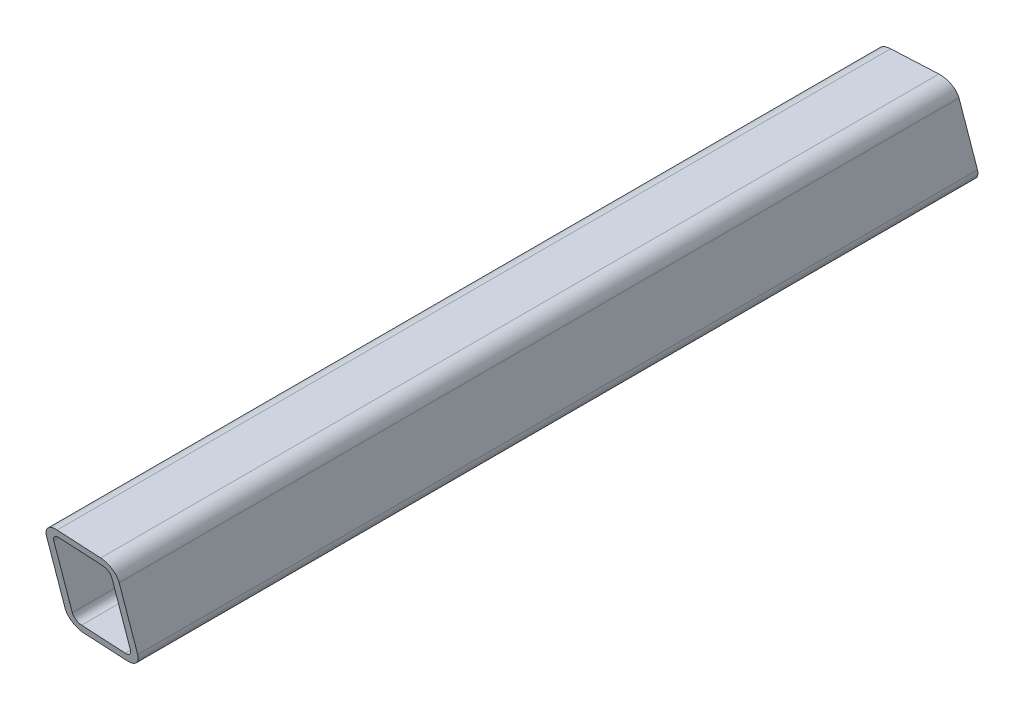
ISO-10303-21;
HEADER;
FILE_DESCRIPTION(('STEP AP214'),'2;1');
FILE_NAME('part.step','',(''),(''),'','','');
FILE_SCHEMA(('AUTOMOTIVE_DESIGN { 1 0 10303 214 1 1 1 1 }'));
ENDSEC;
DATA;
#1=APPLICATION_CONTEXT('core data for automotive mechanical design processes');
#2=APPLICATION_PROTOCOL_DEFINITION('international standard','automotive_design',2000,#1);
#3=PRODUCT_CONTEXT('',#1,'mechanical');
#4=PRODUCT('Part','Part','',(#3));
#5=PRODUCT_RELATED_PRODUCT_CATEGORY('part','',(#4));
#6=PRODUCT_DEFINITION_FORMATION('','',#4);
#7=PRODUCT_DEFINITION_CONTEXT('part definition',#1,'design');
#8=PRODUCT_DEFINITION('design','',#6,#7);
#9=PRODUCT_DEFINITION_SHAPE('','',#8);
#10=(LENGTH_UNIT() NAMED_UNIT(*) SI_UNIT(.MILLI.,.METRE.));
#11=(NAMED_UNIT(*) PLANE_ANGLE_UNIT() SI_UNIT($,.RADIAN.));
#12=(NAMED_UNIT(*) SI_UNIT($,.STERADIAN.) SOLID_ANGLE_UNIT());
#13=UNCERTAINTY_MEASURE_WITH_UNIT(LENGTH_MEASURE(1.E-05),#10,'distance_accuracy_value','');
#14=(GEOMETRIC_REPRESENTATION_CONTEXT(3) GLOBAL_UNCERTAINTY_ASSIGNED_CONTEXT((#13)) GLOBAL_UNIT_ASSIGNED_CONTEXT((#10,
#11,#12)) REPRESENTATION_CONTEXT('',''));
#15=CARTESIAN_POINT('',(0.,0.,0.));
#16=DIRECTION('',(0.,0.,1.));
#17=DIRECTION('',(1.,0.,0.));
#18=AXIS2_PLACEMENT_3D('',#15,#16,#17);
#19=CARTESIAN_POINT('',(-24.,-6.,-219.518847077111));
#20=DIRECTION('',(0.,0.,1.));
#21=DIRECTION('',(1.,0.,0.));
#22=AXIS2_PLACEMENT_3D('',#19,#20,#21);
#23=CYLINDRICAL_SURFACE('',#22,6.);
#24=CARTESIAN_POINT('',(-24.,-6.,-164.604766430197));
#25=DIRECTION('',(0.0474699173292238,-0.250097742672653,0.967056216596947));
#26=DIRECTION('',(-0.18033294434724,0.950093550784267,0.254562907630314));
#27=AXIS2_PLACEMENT_3D('',#24,#25,#26);
#28=ELLIPSE('',#27,6.20439628744014,6.);
#29=CARTESIAN_POINT('',(-28.4872652296078,-2.0169796938563,-163.354420818104));
#30=VERTEX_POINT('',#29);
#31=CARTESIAN_POINT('',(-24.,0.,-163.053060924062));
#32=VERTEX_POINT('',#31);
#33=EDGE_CURVE('E294',#30,#32,#28,.F.);
#34=ORIENTED_EDGE('',*,*,#33,.F.);
#35=CARTESIAN_POINT('',(-24.,-6.,-165.122001598909));
#36=DIRECTION('',(-0.366501226724302,0.,-0.930417567982023));
#37=DIRECTION('',(-0.930417567982023,0.,0.366501226724302));
#38=AXIS2_PLACEMENT_3D('',#35,#36,#37);
#39=ELLIPSE('',#38,6.44871744308673,6.);
#40=CARTESIAN_POINT('',(-30.,-6.00000000000004,-162.75853874522));
#41=VERTEX_POINT('',#40);
#42=EDGE_CURVE('E156',#30,#41,#39,.F.);
#43=ORIENTED_EDGE('',*,*,#42,.T.);
#44=DIRECTION('',(0.,0.,1.));
#45=VECTOR('',#44,1.);
#46=CARTESIAN_POINT('',(-30.,-6.00000000000004,-219.518847077111));
#47=LINE('',#46,#45);
#48=CARTESIAN_POINT('',(-30.,-6.00000000000004,161.107210754806));
#49=VERTEX_POINT('',#48);
#50=EDGE_CURVE('E366',#41,#49,#47,.T.);
#51=ORIENTED_EDGE('',*,*,#50,.T.);
#52=CARTESIAN_POINT('',(-24.,-6.,161.421657430504));
#53=DIRECTION('',(-0.0506732833253562,-0.250058336839836,0.966903845547179));
#54=DIRECTION('',(-0.192035712166833,-0.94764198502731,-0.255141046219688));
#55=AXIS2_PLACEMENT_3D('',#52,#53,#54);
#56=ELLIPSE('',#55,6.20537401690087,6.);
#57=CARTESIAN_POINT('',(-24.,0.,162.973362936639));
#58=VERTEX_POINT('',#57);
#59=EDGE_CURVE('E420',#58,#49,#56,.T.);
#60=ORIENTED_EDGE('',*,*,#59,.F.);
#61=DIRECTION('',(0.,0.,1.));
#62=VECTOR('',#61,1.);
#63=CARTESIAN_POINT('',(-24.,0.,-219.518847077111));
#64=LINE('',#63,#62);
#65=EDGE_CURVE('E369',#32,#58,#64,.T.);
#66=ORIENTED_EDGE('',*,*,#65,.F.);
#67=EDGE_LOOP('',(#34,#43,#51,#60,#66));
#68=FACE_BOUND('',#67,.T.);
#69=ADVANCED_FACE('F137',(#68),#23,.T.);
#70=CARTESIAN_POINT('',(-30.,-6.00000000000004,-219.518847077111));
#71=DIRECTION('',(-1.,0.,0.));
#72=DIRECTION('',(0.,-1.,0.));
#73=AXIS2_PLACEMENT_3D('',#70,#71,#72);
#74=PLANE('',#73);
#75=ORIENTED_EDGE('',*,*,#50,.F.);
#76=DIRECTION('',(0.,1.,0.));
#77=VECTOR('',#76,1.);
#78=CARTESIAN_POINT('',(-30.,-40.0000000000001,-162.75853874522));
#79=LINE('',#78,#77);
#80=CARTESIAN_POINT('',(-30.,-34.,-162.758538745219));
#81=VERTEX_POINT('',#80);
#82=EDGE_CURVE('E166',#81,#41,#79,.T.);
#83=ORIENTED_EDGE('',*,*,#82,.F.);
#84=DIRECTION('',(0.,0.,1.));
#85=VECTOR('',#84,1.);
#86=CARTESIAN_POINT('',(-30.,-34.,-219.518847077111));
#87=LINE('',#86,#85);
#88=CARTESIAN_POINT('',(-30.,-34.,153.865918392841));
#89=VERTEX_POINT('',#88);
#90=EDGE_CURVE('E363',#81,#89,#87,.T.);
#91=ORIENTED_EDGE('',*,*,#90,.T.);
#92=DIRECTION('',(0.,-0.968147640378107,-0.250380004054445));
#93=VECTOR('',#92,1.);
#94=CARTESIAN_POINT('',(-30.,5.64056879613844,164.117666537392));
#95=LINE('',#94,#93);
#96=EDGE_CURVE('E423',#49,#89,#95,.T.);
#97=ORIENTED_EDGE('',*,*,#96,.F.);
#98=EDGE_LOOP('',(#75,#83,#91,#97));
#99=FACE_BOUND('',#98,.T.);
#100=ADVANCED_FACE('F482',(#99),#74,.T.);
#101=CARTESIAN_POINT('',(-24.,-34.0000000000001,-219.518847077111));
#102=DIRECTION('',(0.,0.,1.));
#103=DIRECTION('',(1.,0.,0.));
#104=AXIS2_PLACEMENT_3D('',#101,#102,#103);
#105=CYLINDRICAL_SURFACE('',#104,6.);
#106=ORIENTED_EDGE('',*,*,#90,.F.);
#107=CARTESIAN_POINT('',(-24.,-34.0000000000001,-165.122001598909));
#108=DIRECTION('',(-0.366501226724302,0.,-0.930417567982023));
#109=DIRECTION('',(-0.930417567982023,0.,0.366501226724302));
#110=AXIS2_PLACEMENT_3D('',#107,#108,#109);
#111=ELLIPSE('',#110,6.44871744308672,6.);
#112=CARTESIAN_POINT('',(-24.,-40.0000000000001,-165.122001598909));
#113=VERTEX_POINT('',#112);
#114=EDGE_CURVE('E449',#81,#113,#111,.F.);
#115=ORIENTED_EDGE('',*,*,#114,.T.);
#116=DIRECTION('',(0.,0.,1.));
#117=VECTOR('',#116,1.);
#118=CARTESIAN_POINT('',(-24.,-40.0000000000001,-219.518847077111));
#119=LINE('',#118,#117);
#120=CARTESIAN_POINT('',(-24.,-40.0000000000001,152.628659562403));
#121=VERTEX_POINT('',#120);
#122=EDGE_CURVE('E360',#113,#121,#119,.T.);
#123=ORIENTED_EDGE('',*,*,#122,.T.);
#124=CARTESIAN_POINT('',(-24.,-34.0000000000001,154.180365068539));
#125=DIRECTION('',(-0.0506732833253562,-0.250058336839836,0.966903845547179));
#126=DIRECTION('',(-0.192035712166833,-0.94764198502731,-0.255141046219688));
#127=AXIS2_PLACEMENT_3D('',#124,#125,#126);
#128=ELLIPSE('',#127,6.20537401690087,6.);
#129=EDGE_CURVE('E426',#89,#121,#128,.T.);
#130=ORIENTED_EDGE('',*,*,#129,.F.);
#131=EDGE_LOOP('',(#106,#115,#123,#130));
#132=FACE_BOUND('',#131,.T.);
#133=ADVANCED_FACE('F480',(#132),#105,.T.);
#134=CARTESIAN_POINT('',(-6.00000000000004,-40.0000000000001,-219.518847077111));
#135=DIRECTION('',(0.,-1.,0.));
#136=DIRECTION('',(1.,0.,0.));
#137=AXIS2_PLACEMENT_3D('',#134,#135,#136);
#138=PLANE('',#137);
#139=ORIENTED_EDGE('',*,*,#122,.F.);
#140=DIRECTION('',(-0.930417567982023,0.,0.366501226724302));
#141=VECTOR('',#140,1.);
#142=CARTESIAN_POINT('',(0.,-40.0000000000001,-174.575853013668));
#143=LINE('',#142,#141);
#144=CARTESIAN_POINT('',(-6.00000000000004,-40.0000000000001,-172.212390159978));
#145=VERTEX_POINT('',#144);
#146=EDGE_CURVE('E472',#145,#113,#143,.T.);
#147=ORIENTED_EDGE('',*,*,#146,.F.);
#148=DIRECTION('',(0.,0.,1.));
#149=VECTOR('',#148,1.);
#150=CARTESIAN_POINT('',(-6.00000000000004,-40.0000000000001,-219.518847077111));
#151=LINE('',#150,#149);
#152=CARTESIAN_POINT('',(-6.00000000000004,-40.0000000000001,153.571999589498));
#153=VERTEX_POINT('',#152);
#154=EDGE_CURVE('E300',#145,#153,#151,.T.);
#155=ORIENTED_EDGE('',*,*,#154,.T.);
#156=DIRECTION('',(0.998629534754574,0.,0.0523359562429397));
#157=VECTOR('',#156,1.);
#158=CARTESIAN_POINT('',(-3.09638708918923,-40.0000000000001,153.724171494051));
#159=LINE('',#158,#157);
#160=EDGE_CURVE('E429',#121,#153,#159,.T.);
#161=ORIENTED_EDGE('',*,*,#160,.F.);
#162=EDGE_LOOP('',(#139,#147,#155,#161));
#163=FACE_BOUND('',#162,.T.);
#164=ADVANCED_FACE('F476',(#163),#138,.T.);
#165=CARTESIAN_POINT('',(-6.,-34.0000000000001,-219.518847077111));
#166=DIRECTION('',(0.,0.,1.));
#167=DIRECTION('',(1.,0.,0.));
#168=AXIS2_PLACEMENT_3D('',#165,#166,#167);
#169=CYLINDRICAL_SURFACE('',#168,6.);
#170=ORIENTED_EDGE('',*,*,#154,.F.);
#171=CARTESIAN_POINT('',(-6.,-34.0000000000001,-172.212390159978));
#172=DIRECTION('',(-0.366501226724302,0.,-0.930417567982023));
#173=DIRECTION('',(-0.930417567982023,0.,0.366501226724302));
#174=AXIS2_PLACEMENT_3D('',#171,#172,#173);
#175=ELLIPSE('',#174,6.44871744308673,6.);
#176=CARTESIAN_POINT('',(-1.51273477039227,-37.9830203061438,-173.979970940783));
#177=VERTEX_POINT('',#176);
#178=EDGE_CURVE('E298',#145,#177,#175,.F.);
#179=ORIENTED_EDGE('',*,*,#178,.T.);
#180=CARTESIAN_POINT('',(-6.,-34.0000000000001,-172.72962532869));
#181=DIRECTION('',(0.0474699173292238,-0.250097742672653,0.967056216596947));
#182=DIRECTION('',(-0.18033294434724,0.950093550784267,0.254562907630314));
#183=AXIS2_PLACEMENT_3D('',#180,#181,#182);
#184=ELLIPSE('',#183,6.20439628744014,6.);
#185=CARTESIAN_POINT('',(0.,-34.,-173.024147507533));
#186=VERTEX_POINT('',#185);
#187=EDGE_CURVE('E283',#186,#177,#184,.F.);
#188=ORIENTED_EDGE('',*,*,#187,.F.);
#189=DIRECTION('',(0.,0.,1.));
#190=VECTOR('',#189,1.);
#191=CARTESIAN_POINT('',(0.,-34.,-219.518847077111));
#192=LINE('',#191,#190);
#193=CARTESIAN_POINT('',(0.,-34.,155.438151771332));
#194=VERTEX_POINT('',#193);
#195=EDGE_CURVE('E335',#186,#194,#192,.T.);
#196=ORIENTED_EDGE('',*,*,#195,.T.);
#197=CARTESIAN_POINT('',(-6.,-34.0000000000001,155.123705095634));
#198=DIRECTION('',(-0.0506732833253562,-0.250058336839836,0.966903845547179));
#199=DIRECTION('',(-0.192035712166833,-0.94764198502731,-0.255141046219688));
#200=AXIS2_PLACEMENT_3D('',#197,#198,#199);
#201=ELLIPSE('',#200,6.20537401690087,6.);
#202=EDGE_CURVE('E408',#153,#194,#201,.T.);
#203=ORIENTED_EDGE('',*,*,#202,.F.);
#204=EDGE_LOOP('',(#170,#179,#188,#196,#203));
#205=FACE_BOUND('',#204,.T.);
#206=ADVANCED_FACE('F139',(#205),#169,.T.);
#207=CARTESIAN_POINT('',(-24.,-6.,-219.518847077111));
#208=DIRECTION('',(0.,0.,1.));
#209=DIRECTION('',(1.,0.,0.));
#210=AXIS2_PLACEMENT_3D('',#207,#208,#209);
#211=CYLINDRICAL_SURFACE('',#210,3.);
#212=CARTESIAN_POINT('',(-24.,-6.,-165.122001598909));
#213=DIRECTION('',(-0.366501226724302,0.,-0.930417567982023));
#214=DIRECTION('',(-0.930417567982023,0.,0.366501226724302));
#215=AXIS2_PLACEMENT_3D('',#212,#213,#214);
#216=ELLIPSE('',#215,3.22435872154336,3.);
#217=CARTESIAN_POINT('',(-26.6097272501841,-4.52036366642121,-164.094002696564));
#218=VERTEX_POINT('',#217);
#219=CARTESIAN_POINT('',(-27.,-6.00000000000002,-163.940270172064));
#220=VERTEX_POINT('',#219);
#221=EDGE_CURVE('E304',#218,#220,#216,.F.);
#222=ORIENTED_EDGE('',*,*,#221,.F.);
#223=CARTESIAN_POINT('',(-24.,-6.,-164.604766430197));
#224=DIRECTION('',(0.0474699173292238,-0.250097742672653,0.967056216596947));
#225=DIRECTION('',(-0.18033294434724,0.950093550784267,0.254562907630314));
#226=AXIS2_PLACEMENT_3D('',#223,#224,#225);
#227=ELLIPSE('',#226,3.10219814372007,3.);
#228=CARTESIAN_POINT('',(-24.,-3.,-163.82891367713));
#229=VERTEX_POINT('',#228);
#230=EDGE_CURVE('E402',#218,#229,#227,.F.);
#231=ORIENTED_EDGE('',*,*,#230,.T.);
#232=DIRECTION('',(0.,0.,1.));
#233=VECTOR('',#232,1.);
#234=CARTESIAN_POINT('',(-24.,-3.,-219.518847077111));
#235=LINE('',#234,#233);
#236=CARTESIAN_POINT('',(-24.,-3.,162.197510183572));
#237=VERTEX_POINT('',#236);
#238=EDGE_CURVE('E345',#229,#237,#235,.T.);
#239=ORIENTED_EDGE('',*,*,#238,.T.);
#240=CARTESIAN_POINT('',(-24.,-6.,161.421657430504));
#241=DIRECTION('',(-0.0506732833253562,-0.250058336839836,0.966903845547179));
#242=DIRECTION('',(-0.192035712166833,-0.94764198502731,-0.255141046219688));
#243=AXIS2_PLACEMENT_3D('',#240,#241,#242);
#244=ELLIPSE('',#243,3.10268700845044,3.);
#245=CARTESIAN_POINT('',(-27.,-6.00000000000002,161.264434092655));
#246=VERTEX_POINT('',#245);
#247=EDGE_CURVE('E440',#237,#246,#244,.T.);
#248=ORIENTED_EDGE('',*,*,#247,.T.);
#249=DIRECTION('',(0.,0.,1.));
#250=VECTOR('',#249,1.);
#251=CARTESIAN_POINT('',(-27.,-6.00000000000002,-219.518847077111));
#252=LINE('',#251,#250);
#253=EDGE_CURVE('E342',#220,#246,#252,.T.);
#254=ORIENTED_EDGE('',*,*,#253,.F.);
#255=EDGE_LOOP('',(#222,#231,#239,#248,#254));
#256=FACE_BOUND('',#255,.T.);
#257=ADVANCED_FACE('F547',(#256),#211,.F.);
#258=CARTESIAN_POINT('',(-27.,-34.0000000000001,-219.518847077111));
#259=DIRECTION('',(-1.,0.,0.));
#260=DIRECTION('',(0.,-1.,0.));
#261=AXIS2_PLACEMENT_3D('',#258,#259,#260);
#262=PLANE('',#261);
#263=DIRECTION('',(0.,-1.,0.));
#264=VECTOR('',#263,1.);
#265=CARTESIAN_POINT('',(-27.,-34.0000000000001,-163.940270172064));
#266=LINE('',#265,#264);
#267=CARTESIAN_POINT('',(-27.,-34.,-163.940270172064));
#268=VERTEX_POINT('',#267);
#269=EDGE_CURVE('E457',#220,#268,#266,.T.);
#270=ORIENTED_EDGE('',*,*,#269,.F.);
#271=ORIENTED_EDGE('',*,*,#253,.T.);
#272=DIRECTION('',(0.,-0.968147640378107,-0.250380004054445));
#273=VECTOR('',#272,1.);
#274=CARTESIAN_POINT('',(-27.,-20.6422187971713,157.47769883772));
#275=LINE('',#274,#273);
#276=CARTESIAN_POINT('',(-27.,-34.,154.02314173069));
#277=VERTEX_POINT('',#276);
#278=EDGE_CURVE('E443',#246,#277,#275,.T.);
#279=ORIENTED_EDGE('',*,*,#278,.T.);
#280=DIRECTION('',(0.,0.,1.));
#281=VECTOR('',#280,1.);
#282=CARTESIAN_POINT('',(-27.,-34.,-219.518847077111));
#283=LINE('',#282,#281);
#284=EDGE_CURVE('E339',#268,#277,#283,.T.);
#285=ORIENTED_EDGE('',*,*,#284,.F.);
#286=EDGE_LOOP('',(#270,#271,#279,#285));
#287=FACE_BOUND('',#286,.T.);
#288=ADVANCED_FACE('F553',(#287),#262,.F.);
#289=CARTESIAN_POINT('',(-24.,-34.0000000000001,-219.518847077111));
#290=DIRECTION('',(0.,0.,1.));
#291=DIRECTION('',(1.,0.,0.));
#292=AXIS2_PLACEMENT_3D('',#289,#290,#291);
#293=CYLINDRICAL_SURFACE('',#292,3.);
#294=CARTESIAN_POINT('',(-24.,-34.0000000000001,-165.122001598909));
#295=DIRECTION('',(-0.366501226724302,0.,-0.930417567982023));
#296=DIRECTION('',(-0.930417567982023,0.,0.366501226724302));
#297=AXIS2_PLACEMENT_3D('',#294,#295,#296);
#298=ELLIPSE('',#297,3.22435872154336,3.);
#299=CARTESIAN_POINT('',(-24.,-37.0000000000001,-165.122001598909));
#300=VERTEX_POINT('',#299);
#301=EDGE_CURVE('E461',#268,#300,#298,.F.);
#302=ORIENTED_EDGE('',*,*,#301,.F.);
#303=ORIENTED_EDGE('',*,*,#284,.T.);
#304=CARTESIAN_POINT('',(-24.,-34.0000000000001,154.180365068539));
#305=DIRECTION('',(-0.0506732833253562,-0.250058336839836,0.966903845547179));
#306=DIRECTION('',(-0.192035712166833,-0.94764198502731,-0.255141046219688));
#307=AXIS2_PLACEMENT_3D('',#304,#305,#306);
#308=ELLIPSE('',#307,3.10268700845043,3.);
#309=CARTESIAN_POINT('',(-24.,-37.0000000000001,153.404512315471));
#310=VERTEX_POINT('',#309);
#311=EDGE_CURVE('E446',#277,#310,#308,.T.);
#312=ORIENTED_EDGE('',*,*,#311,.T.);
#313=DIRECTION('',(0.,0.,1.));
#314=VECTOR('',#313,1.);
#315=CARTESIAN_POINT('',(-24.,-37.0000000000001,-219.518847077111));
#316=LINE('',#315,#314);
#317=EDGE_CURVE('E336',#300,#310,#316,.T.);
#318=ORIENTED_EDGE('',*,*,#317,.F.);
#319=EDGE_LOOP('',(#302,#303,#312,#318));
#320=FACE_BOUND('',#319,.T.);
#321=ADVANCED_FACE('F561',(#320),#293,.F.);
#322=CARTESIAN_POINT('',(-6.,-37.0000000000001,-219.518847077111));
#323=DIRECTION('',(0.,-1.,0.));
#324=DIRECTION('',(1.,0.,0.));
#325=AXIS2_PLACEMENT_3D('',#322,#323,#324);
#326=PLANE('',#325);
#327=DIRECTION('',(0.930417567982023,0.,-0.366501226724302));
#328=VECTOR('',#327,1.);
#329=CARTESIAN_POINT('',(10.1314630189261,-37.0000000000001,-178.566742430128));
#330=LINE('',#329,#328);
#331=CARTESIAN_POINT('',(-6.00000000000004,-37.0000000000001,-172.212390159978));
#332=VERTEX_POINT('',#331);
#333=EDGE_CURVE('E465',#300,#332,#330,.T.);
#334=ORIENTED_EDGE('',*,*,#333,.F.);
#335=ORIENTED_EDGE('',*,*,#317,.T.);
#336=DIRECTION('',(0.998629534754574,0.,0.0523359562429397));
#337=VECTOR('',#336,1.);
#338=CARTESIAN_POINT('',(-3.13693643718926,-37.0000000000001,154.497899145839));
#339=LINE('',#338,#337);
#340=CARTESIAN_POINT('',(-6.00000000000004,-37.0000000000001,154.347852342566));
#341=VERTEX_POINT('',#340);
#342=EDGE_CURVE('E357',#310,#341,#339,.T.);
#343=ORIENTED_EDGE('',*,*,#342,.T.);
#344=DIRECTION('',(0.,0.,1.));
#345=VECTOR('',#344,1.);
#346=CARTESIAN_POINT('',(-6.00000000000004,-37.0000000000001,-219.518847077111));
#347=LINE('',#346,#345);
#348=EDGE_CURVE('E333',#332,#341,#347,.T.);
#349=ORIENTED_EDGE('',*,*,#348,.F.);
#350=EDGE_LOOP('',(#334,#335,#343,#349));
#351=FACE_BOUND('',#350,.T.);
#352=ADVANCED_FACE('F529',(#351),#326,.F.);
#353=CARTESIAN_POINT('',(-6.,-34.0000000000001,-219.518847077111));
#354=DIRECTION('',(0.,0.,1.));
#355=DIRECTION('',(1.,0.,0.));
#356=AXIS2_PLACEMENT_3D('',#353,#354,#355);
#357=CYLINDRICAL_SURFACE('',#356,3.);
#358=CARTESIAN_POINT('',(-6.,-34.0000000000001,-172.212390159978));
#359=DIRECTION('',(-0.366501226724302,0.,-0.930417567982023));
#360=DIRECTION('',(-0.930417567982023,0.,0.366501226724302));
#361=AXIS2_PLACEMENT_3D('',#358,#359,#360);
#362=ELLIPSE('',#361,3.22435872154336,3.);
#363=CARTESIAN_POINT('',(-3.39027274981594,-35.4796363335789,-173.240389062324));
#364=VERTEX_POINT('',#363);
#365=EDGE_CURVE('E310',#332,#364,#362,.F.);
#366=ORIENTED_EDGE('',*,*,#365,.F.);
#367=ORIENTED_EDGE('',*,*,#348,.T.);
#368=CARTESIAN_POINT('',(-6.,-34.0000000000001,155.123705095634));
#369=DIRECTION('',(-0.0506732833253562,-0.250058336839836,0.966903845547179));
#370=DIRECTION('',(-0.192035712166833,-0.94764198502731,-0.255141046219688));
#371=AXIS2_PLACEMENT_3D('',#368,#369,#370);
#372=ELLIPSE('',#371,3.10268700845044,3.);
#373=CARTESIAN_POINT('',(-3.,-34.,155.280928433483));
#374=VERTEX_POINT('',#373);
#375=EDGE_CURVE('E432',#341,#374,#372,.T.);
#376=ORIENTED_EDGE('',*,*,#375,.T.);
#377=DIRECTION('',(0.,0.,1.));
#378=VECTOR('',#377,1.);
#379=CARTESIAN_POINT('',(-3.,-34.,-219.518847077111));
#380=LINE('',#379,#378);
#381=CARTESIAN_POINT('',(-3.,-34.,-172.876886418111));
#382=VERTEX_POINT('',#381);
#383=EDGE_CURVE('E354',#382,#374,#380,.T.);
#384=ORIENTED_EDGE('',*,*,#383,.F.);
#385=CARTESIAN_POINT('',(-6.,-34.0000000000001,-172.72962532869));
#386=DIRECTION('',(0.0474699173292238,-0.250097742672653,0.967056216596947));
#387=DIRECTION('',(-0.18033294434724,0.950093550784267,0.254562907630314));
#388=AXIS2_PLACEMENT_3D('',#385,#386,#387);
#389=ELLIPSE('',#388,3.10219814372007,3.);
#390=EDGE_CURVE('E293',#382,#364,#389,.F.);
#391=ORIENTED_EDGE('',*,*,#390,.T.);
#392=EDGE_LOOP('',(#366,#367,#376,#384,#391));
#393=FACE_BOUND('',#392,.T.);
#394=ADVANCED_FACE('F506',(#393),#357,.F.);
#395=CARTESIAN_POINT('',(-7.53920807287807,39.720712119409,-153.588597690819));
#396=DIRECTION('',(0.0474699173292238,-0.250097742672653,0.967056216596947));
#397=DIRECTION('',(0.,-0.968147640378107,-0.250380004054445));
#398=AXIS2_PLACEMENT_3D('',#395,#396,#397);
#399=PLANE('',#398);
#400=DIRECTION('',(0.583913035590278,-0.778550714120373,-0.230009461567134));
#401=VECTOR('',#400,1.);
#402=CARTESIAN_POINT('',(-41.6307376616032,15.507650215471,-158.177069341185));
#403=LINE('',#402,#401);
#404=EDGE_CURVE('E12',#30,#218,#403,.T.);
#405=ORIENTED_EDGE('',*,*,#404,.F.);
#406=ORIENTED_EDGE('',*,*,#33,.T.);
#407=DIRECTION('',(0.99879740458965,0.,-0.049027997970334));
#408=VECTOR('',#407,1.);
#409=CARTESIAN_POINT('',(-3.27819222410891,0.,-164.070232920014));
#410=LINE('',#409,#408);
#411=CARTESIAN_POINT('',(-6.00000000000004,0.,-163.93662746059));
#412=VERTEX_POINT('',#411);
#413=EDGE_CURVE('E327',#32,#412,#410,.T.);
#414=ORIENTED_EDGE('',*,*,#413,.T.);
#415=CARTESIAN_POINT('',(-6.,-6.,-165.488332966725));
#416=DIRECTION('',(0.0474699173292238,-0.250097742672653,0.967056216596947));
#417=DIRECTION('',(-0.18033294434724,0.950093550784267,0.254562907630314));
#418=AXIS2_PLACEMENT_3D('',#415,#416,#417);
#419=ELLIPSE('',#418,6.20439628744014,6.);
#420=CARTESIAN_POINT('',(0.,-6.00000000000004,-165.782855145568));
#421=VERTEX_POINT('',#420);
#422=EDGE_CURVE('E324',#412,#421,#419,.F.);
#423=ORIENTED_EDGE('',*,*,#422,.T.);
#424=DIRECTION('',(0.,-0.968147640378107,-0.250380004054445));
#425=VECTOR('',#424,1.);
#426=CARTESIAN_POINT('',(0.,-19.0258629209461,-169.151572348334));
#427=LINE('',#426,#425);
#428=EDGE_CURVE('E289',#421,#186,#427,.T.);
#429=ORIENTED_EDGE('',*,*,#428,.T.);
#430=ORIENTED_EDGE('',*,*,#187,.T.);
#431=EDGE_CURVE('E141',#364,#177,#403,.T.);
#432=ORIENTED_EDGE('',*,*,#431,.F.);
#433=ORIENTED_EDGE('',*,*,#390,.F.);
#434=DIRECTION('',(0.,-0.968147640378107,-0.250380004054445));
#435=VECTOR('',#434,1.);
#436=CARTESIAN_POINT('',(-3.,-45.3062356173174,-175.80087776162));
#437=LINE('',#436,#435);
#438=CARTESIAN_POINT('',(-3.,-6.00000000000005,-165.635594056146));
#439=VERTEX_POINT('',#438);
#440=EDGE_CURVE('E328',#439,#382,#437,.T.);
#441=ORIENTED_EDGE('',*,*,#440,.F.);
#442=CARTESIAN_POINT('',(-6.,-6.,-165.488332966725));
#443=DIRECTION('',(0.0474699173292238,-0.250097742672653,0.967056216596947));
#444=DIRECTION('',(-0.18033294434724,0.950093550784267,0.254562907630314));
#445=AXIS2_PLACEMENT_3D('',#442,#443,#444);
#446=ELLIPSE('',#445,3.10219814372007,3.);
#447=CARTESIAN_POINT('',(-6.00000000000002,-3.,-164.712480213657));
#448=VERTEX_POINT('',#447);
#449=EDGE_CURVE('E314',#448,#439,#446,.F.);
#450=ORIENTED_EDGE('',*,*,#449,.F.);
#451=DIRECTION('',(0.99879740458965,0.,-0.049027997970334));
#452=VECTOR('',#451,1.);
#453=CARTESIAN_POINT('',(-3.31618498637737,-3.,-164.844220721228));
#454=LINE('',#453,#452);
#455=EDGE_CURVE('E319',#229,#448,#454,.T.);
#456=ORIENTED_EDGE('',*,*,#455,.F.);
#457=ORIENTED_EDGE('',*,*,#230,.F.);
#458=EDGE_LOOP('',(#405,#406,#414,#423,#429,#430,#432,#433,#441,#450,#456,#457));
#459=FACE_BOUND('',#458,.T.);
#460=ADVANCED_FACE('F285',(#459),#399,.F.);
#461=CARTESIAN_POINT('',(0.,-6.00000000000004,-219.518847077111));
#462=DIRECTION('',(1.,0.,0.));
#463=DIRECTION('',(0.,0.,-1.));
#464=AXIS2_PLACEMENT_3D('',#461,#462,#463);
#465=PLANE('',#464);
#466=ORIENTED_EDGE('',*,*,#428,.F.);
#467=DIRECTION('',(0.,0.,1.));
#468=VECTOR('',#467,1.);
#469=CARTESIAN_POINT('',(0.,-6.00000000000004,-219.518847077111));
#470=LINE('',#469,#468);
#471=CARTESIAN_POINT('',(0.,-6.00000000000004,162.679444133297));
#472=VERTEX_POINT('',#471);
#473=EDGE_CURVE('E375',#421,#472,#470,.T.);
#474=ORIENTED_EDGE('',*,*,#473,.T.);
#475=DIRECTION('',(0.,0.968147640378107,0.250380004054445));
#476=VECTOR('',#475,1.);
#477=CARTESIAN_POINT('',(0.,5.25945186255599,165.591336375162));
#478=LINE('',#477,#476);
#479=EDGE_CURVE('E411',#194,#472,#478,.T.);
#480=ORIENTED_EDGE('',*,*,#479,.F.);
#481=ORIENTED_EDGE('',*,*,#195,.F.);
#482=EDGE_LOOP('',(#466,#474,#480,#481));
#483=FACE_BOUND('',#482,.T.);
#484=ADVANCED_FACE('F499',(#483),#465,.T.);
#485=CARTESIAN_POINT('',(-6.,-6.,-219.518847077111));
#486=DIRECTION('',(0.,0.,1.));
#487=DIRECTION('',(1.,0.,0.));
#488=AXIS2_PLACEMENT_3D('',#485,#486,#487);
#489=CYLINDRICAL_SURFACE('',#488,6.);
#490=ORIENTED_EDGE('',*,*,#422,.F.);
#491=DIRECTION('',(0.,0.,1.));
#492=VECTOR('',#491,1.);
#493=CARTESIAN_POINT('',(-6.00000000000004,0.,-219.518847077111));
#494=LINE('',#493,#492);
#495=CARTESIAN_POINT('',(-6.00000000000004,0.,163.916702963734));
#496=VERTEX_POINT('',#495);
#497=EDGE_CURVE('E372',#412,#496,#494,.T.);
#498=ORIENTED_EDGE('',*,*,#497,.T.);
#499=CARTESIAN_POINT('',(-6.,-6.,162.364997457599));
#500=DIRECTION('',(-0.0506732833253562,-0.250058336839836,0.966903845547179));
#501=DIRECTION('',(-0.192035712166833,-0.94764198502731,-0.255141046219688));
#502=AXIS2_PLACEMENT_3D('',#499,#500,#501);
#503=ELLIPSE('',#502,6.20537401690087,6.);
#504=EDGE_CURVE('E414',#472,#496,#503,.T.);
#505=ORIENTED_EDGE('',*,*,#504,.F.);
#506=ORIENTED_EDGE('',*,*,#473,.F.);
#507=EDGE_LOOP('',(#490,#498,#505,#506));
#508=FACE_BOUND('',#507,.T.);
#509=ADVANCED_FACE('F495',(#508),#489,.T.);
#510=CARTESIAN_POINT('',(-6.00000000000004,0.,-219.518847077111));
#511=DIRECTION('',(0.,1.,0.));
#512=DIRECTION('',(0.,0.,1.));
#513=AXIS2_PLACEMENT_3D('',#510,#511,#512);
#514=PLANE('',#513);
#515=ORIENTED_EDGE('',*,*,#413,.F.);
#516=ORIENTED_EDGE('',*,*,#65,.T.);
#517=DIRECTION('',(-0.998629534754574,0.,-0.0523359562429396));
#518=VECTOR('',#517,1.);
#519=CARTESIAN_POINT('',(-3.63704506252348,0.,164.040540184553));
#520=LINE('',#519,#518);
#521=EDGE_CURVE('E417',#496,#58,#520,.T.);
#522=ORIENTED_EDGE('',*,*,#521,.F.);
#523=ORIENTED_EDGE('',*,*,#497,.F.);
#524=EDGE_LOOP('',(#515,#516,#522,#523));
#525=FACE_BOUND('',#524,.T.);
#526=ADVANCED_FACE('F490',(#525),#514,.T.);
#527=CARTESIAN_POINT('',(-3.,-34.0000000000001,-219.518847077111));
#528=DIRECTION('',(1.,0.,0.));
#529=DIRECTION('',(0.,0.,-1.));
#530=AXIS2_PLACEMENT_3D('',#527,#528,#529);
#531=PLANE('',#530);
#532=DIRECTION('',(0.,0.,1.));
#533=VECTOR('',#532,1.);
#534=CARTESIAN_POINT('',(-3.,-6.00000000000004,-219.518847077111));
#535=LINE('',#534,#533);
#536=CARTESIAN_POINT('',(-3.,-6.00000000000004,162.522220795448));
#537=VERTEX_POINT('',#536);
#538=EDGE_CURVE('E351',#439,#537,#535,.T.);
#539=ORIENTED_EDGE('',*,*,#538,.F.);
#540=ORIENTED_EDGE('',*,*,#440,.T.);
#541=ORIENTED_EDGE('',*,*,#383,.T.);
#542=DIRECTION('',(0.,0.968147640378107,0.250380004054445));
#543=VECTOR('',#542,1.);
#544=CARTESIAN_POINT('',(-3.,-20.9471123440373,158.656634707937));
#545=LINE('',#544,#543);
#546=EDGE_CURVE('E435',#374,#537,#545,.T.);
#547=ORIENTED_EDGE('',*,*,#546,.T.);
#548=EDGE_LOOP('',(#539,#540,#541,#547));
#549=FACE_BOUND('',#548,.T.);
#550=ADVANCED_FACE('F383',(#549),#531,.F.);
#551=CARTESIAN_POINT('',(-6.,-6.,-219.518847077111));
#552=DIRECTION('',(0.,0.,1.));
#553=DIRECTION('',(1.,0.,0.));
#554=AXIS2_PLACEMENT_3D('',#551,#552,#553);
#555=CYLINDRICAL_SURFACE('',#554,3.);
#556=DIRECTION('',(0.,0.,1.));
#557=VECTOR('',#556,1.);
#558=CARTESIAN_POINT('',(-6.00000000000002,-3.,-219.518847077111));
#559=LINE('',#558,#557);
#560=CARTESIAN_POINT('',(-6.00000000000002,-3.,163.140850210666));
#561=VERTEX_POINT('',#560);
#562=EDGE_CURVE('E348',#448,#561,#559,.T.);
#563=ORIENTED_EDGE('',*,*,#562,.F.);
#564=ORIENTED_EDGE('',*,*,#449,.T.);
#565=ORIENTED_EDGE('',*,*,#538,.T.);
#566=CARTESIAN_POINT('',(-6.,-6.,162.364997457599));
#567=DIRECTION('',(-0.0506732833253562,-0.250058336839836,0.966903845547179));
#568=DIRECTION('',(-0.192035712166833,-0.94764198502731,-0.255141046219688));
#569=AXIS2_PLACEMENT_3D('',#566,#567,#568);
#570=ELLIPSE('',#569,3.10268700845044,3.);
#571=EDGE_CURVE('E394',#537,#561,#570,.T.);
#572=ORIENTED_EDGE('',*,*,#571,.T.);
#573=EDGE_LOOP('',(#563,#564,#565,#572));
#574=FACE_BOUND('',#573,.T.);
#575=ADVANCED_FACE('F390',(#574),#555,.F.);
#576=CARTESIAN_POINT('',(-6.,-3.,-219.518847077111));
#577=DIRECTION('',(0.,1.,0.));
#578=DIRECTION('',(0.,0.,1.));
#579=AXIS2_PLACEMENT_3D('',#576,#577,#578);
#580=PLANE('',#579);
#581=ORIENTED_EDGE('',*,*,#238,.F.);
#582=ORIENTED_EDGE('',*,*,#455,.T.);
#583=ORIENTED_EDGE('',*,*,#562,.T.);
#584=DIRECTION('',(-0.998629534754574,0.,-0.0523359562429396));
#585=VECTOR('',#584,1.);
#586=CARTESIAN_POINT('',(-3.59649571452337,-3.,163.266812532765));
#587=LINE('',#586,#585);
#588=EDGE_CURVE('E438',#561,#237,#587,.T.);
#589=ORIENTED_EDGE('',*,*,#588,.T.);
#590=EDGE_LOOP('',(#581,#582,#583,#589));
#591=FACE_BOUND('',#590,.T.);
#592=ADVANCED_FACE('F399',(#591),#580,.F.);
#593=CARTESIAN_POINT('',(-8.04670102449445,-39.7081961773265,153.540202133674));
#594=DIRECTION('',(-0.0506732833253562,-0.250058336839836,0.966903845547179));
#595=DIRECTION('',(0.,-0.968147640378107,-0.250380004054445));
#596=AXIS2_PLACEMENT_3D('',#593,#594,#595);
#597=PLANE('',#596);
#598=ORIENTED_EDGE('',*,*,#375,.F.);
#599=ORIENTED_EDGE('',*,*,#342,.F.);
#600=ORIENTED_EDGE('',*,*,#311,.F.);
#601=ORIENTED_EDGE('',*,*,#278,.F.);
#602=ORIENTED_EDGE('',*,*,#247,.F.);
#603=ORIENTED_EDGE('',*,*,#588,.F.);
#604=ORIENTED_EDGE('',*,*,#571,.F.);
#605=ORIENTED_EDGE('',*,*,#546,.F.);
#606=EDGE_LOOP('',(#598,#599,#600,#601,#602,#603,#604,#605));
#607=FACE_BOUND('',#606,.T.);
#608=ORIENTED_EDGE('',*,*,#160,.T.);
#609=ORIENTED_EDGE('',*,*,#202,.T.);
#610=ORIENTED_EDGE('',*,*,#479,.T.);
#611=ORIENTED_EDGE('',*,*,#504,.T.);
#612=ORIENTED_EDGE('',*,*,#521,.T.);
#613=ORIENTED_EDGE('',*,*,#59,.T.);
#614=ORIENTED_EDGE('',*,*,#96,.T.);
#615=ORIENTED_EDGE('',*,*,#129,.T.);
#616=EDGE_LOOP('',(#608,#609,#610,#611,#612,#613,#614,#615));
#617=FACE_BOUND('',#616,.T.);
#618=ADVANCED_FACE('F485',(#607,#617),#597,.T.);
#619=CARTESIAN_POINT('',(0.,-40.0000000000001,-174.575853013668));
#620=DIRECTION('',(-0.366501226724302,0.,-0.930417567982023));
#621=DIRECTION('',(-0.930417567982023,0.,0.366501226724302));
#622=AXIS2_PLACEMENT_3D('',#619,#620,#621);
#623=PLANE('',#622);
#624=ORIENTED_EDGE('',*,*,#114,.F.);
#625=ORIENTED_EDGE('',*,*,#82,.T.);
#626=ORIENTED_EDGE('',*,*,#42,.F.);
#627=ORIENTED_EDGE('',*,*,#404,.T.);
#628=ORIENTED_EDGE('',*,*,#221,.T.);
#629=ORIENTED_EDGE('',*,*,#269,.T.);
#630=ORIENTED_EDGE('',*,*,#301,.T.);
#631=ORIENTED_EDGE('',*,*,#333,.T.);
#632=ORIENTED_EDGE('',*,*,#365,.T.);
#633=ORIENTED_EDGE('',*,*,#431,.T.);
#634=ORIENTED_EDGE('',*,*,#178,.F.);
#635=ORIENTED_EDGE('',*,*,#146,.T.);
#636=EDGE_LOOP('',(#624,#625,#626,#627,#628,#629,#630,#631,#632,#633,#634,#635));
#637=FACE_BOUND('',#636,.T.);
#638=ADVANCED_FACE('F308',(#637),#623,.T.);
#639=CLOSED_SHELL('',(#69,#100,#133,#164,#206,#257,#288,#321,#352,#394,#460,#484,#509,#526,#550,
#575,#592,#618,#638));
#640=MANIFOLD_SOLID_BREP('B2',#639);
#641=ADVANCED_BREP_SHAPE_REPRESENTATION('',(#18,#640),#14);
#642=SHAPE_DEFINITION_REPRESENTATION(#9,#641);
ENDSEC;
END-ISO-10303-21;
